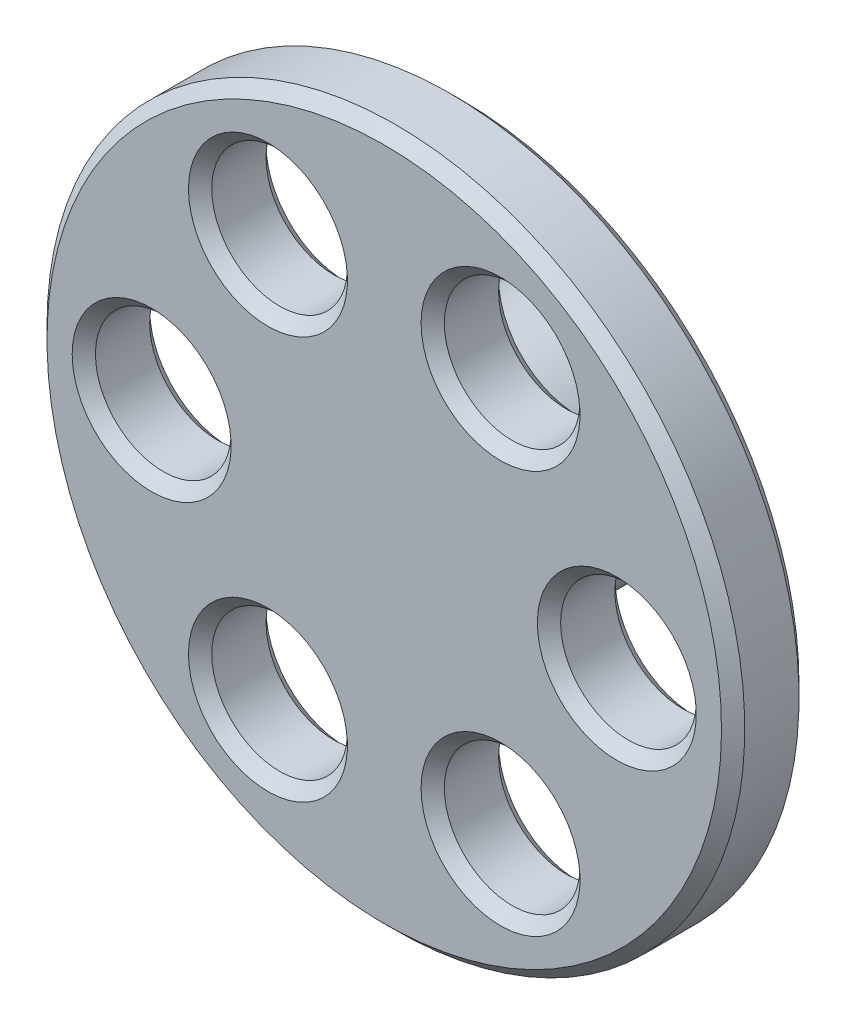
ISO-10303-21;
HEADER;
FILE_DESCRIPTION(('STEP AP214'),'2;1');
FILE_NAME('part.step','',(''),(''),'','','');
FILE_SCHEMA(('AUTOMOTIVE_DESIGN { 1 0 10303 214 1 1 1 1 }'));
ENDSEC;
DATA;
#1=APPLICATION_CONTEXT('core data for automotive mechanical design processes');
#2=APPLICATION_PROTOCOL_DEFINITION('international standard','automotive_design',2000,#1);
#3=PRODUCT_CONTEXT('',#1,'mechanical');
#4=PRODUCT('Part','Part','',(#3));
#5=PRODUCT_RELATED_PRODUCT_CATEGORY('part','',(#4));
#6=PRODUCT_DEFINITION_FORMATION('','',#4);
#7=PRODUCT_DEFINITION_CONTEXT('part definition',#1,'design');
#8=PRODUCT_DEFINITION('design','',#6,#7);
#9=PRODUCT_DEFINITION_SHAPE('','',#8);
#10=(LENGTH_UNIT() NAMED_UNIT(*) SI_UNIT(.MILLI.,.METRE.));
#11=(NAMED_UNIT(*) PLANE_ANGLE_UNIT() SI_UNIT($,.RADIAN.));
#12=(NAMED_UNIT(*) SI_UNIT($,.STERADIAN.) SOLID_ANGLE_UNIT());
#13=UNCERTAINTY_MEASURE_WITH_UNIT(LENGTH_MEASURE(1.E-05),#10,'distance_accuracy_value','');
#14=(GEOMETRIC_REPRESENTATION_CONTEXT(3) GLOBAL_UNCERTAINTY_ASSIGNED_CONTEXT((#13)) GLOBAL_UNIT_ASSIGNED_CONTEXT((#10,
#11,#12)) REPRESENTATION_CONTEXT('',''));
#15=CARTESIAN_POINT('',(0.,0.,0.));
#16=DIRECTION('',(0.,0.,1.));
#17=DIRECTION('',(1.,0.,0.));
#18=AXIS2_PLACEMENT_3D('',#15,#16,#17);
#19=CARTESIAN_POINT('',(-3.,-5.19615242270662,-14.35));
#20=DIRECTION('',(0.,0.,-1.));
#21=DIRECTION('',(0.5,-0.866025403784442,0.));
#22=AXIS2_PLACEMENT_3D('',#19,#20,#21);
#23=CYLINDRICAL_SURFACE('',#22,1.75);
#24=CARTESIAN_POINT('',(-3.,-5.19615242270662,-14.65));
#25=DIRECTION('',(0.,0.,1.));
#26=DIRECTION('',(0.5,-0.866025403784442,0.));
#27=AXIS2_PLACEMENT_3D('',#24,#25,#26);
#28=CIRCLE('',#27,1.75);
#29=CARTESIAN_POINT('',(-2.12500000000003,-6.71169687932939,-14.65));
#30=VERTEX_POINT('',#29);
#31=EDGE_CURVE('E11',#30,#30,#28,.T.);
#32=ORIENTED_EDGE('',*,*,#31,.T.);
#33=EDGE_LOOP('',(#32));
#34=FACE_BOUND('',#33,.T.);
#35=CARTESIAN_POINT('',(-3.,-5.19615242270662,-16.05));
#36=DIRECTION('',(0.,0.,-1.));
#37=DIRECTION('',(0.5,-0.866025403784442,0.));
#38=AXIS2_PLACEMENT_3D('',#35,#36,#37);
#39=CIRCLE('',#38,1.75);
#40=CARTESIAN_POINT('',(-2.12500000000003,-6.71169687932939,-16.05));
#41=VERTEX_POINT('',#40);
#42=EDGE_CURVE('E28',#41,#41,#39,.T.);
#43=ORIENTED_EDGE('',*,*,#42,.T.);
#44=EDGE_LOOP('',(#43));
#45=FACE_BOUND('',#44,.T.);
#46=ADVANCED_FACE('F17',(#34,#45),#23,.F.);
#47=CARTESIAN_POINT('',(6.,0.,-14.35));
#48=DIRECTION('',(0.,0.,-1.));
#49=DIRECTION('',(0.5,-0.866025403784442,0.));
#50=AXIS2_PLACEMENT_3D('',#47,#48,#49);
#51=CYLINDRICAL_SURFACE('',#50,1.75);
#52=CARTESIAN_POINT('',(6.,0.,-14.65));
#53=DIRECTION('',(0.,0.,1.));
#54=DIRECTION('',(0.5,-0.866025403784442,0.));
#55=AXIS2_PLACEMENT_3D('',#52,#53,#54);
#56=CIRCLE('',#55,1.75);
#57=CARTESIAN_POINT('',(6.875,-1.5155444566228,-14.65));
#58=VERTEX_POINT('',#57);
#59=EDGE_CURVE('E237',#58,#58,#56,.T.);
#60=ORIENTED_EDGE('',*,*,#59,.T.);
#61=EDGE_LOOP('',(#60));
#62=FACE_BOUND('',#61,.T.);
#63=CARTESIAN_POINT('',(6.,0.,-16.05));
#64=DIRECTION('',(0.,0.,-1.));
#65=DIRECTION('',(0.5,-0.866025403784442,0.));
#66=AXIS2_PLACEMENT_3D('',#63,#64,#65);
#67=CIRCLE('',#66,1.75);
#68=CARTESIAN_POINT('',(6.875,-1.5155444566228,-16.05));
#69=VERTEX_POINT('',#68);
#70=EDGE_CURVE('E233',#69,#69,#67,.T.);
#71=ORIENTED_EDGE('',*,*,#70,.T.);
#72=EDGE_LOOP('',(#71));
#73=FACE_BOUND('',#72,.T.);
#74=ADVANCED_FACE('F263',(#62,#73),#51,.F.);
#75=CARTESIAN_POINT('',(-6.,0.,-14.35));
#76=DIRECTION('',(0.,0.,-1.));
#77=DIRECTION('',(0.5,-0.866025403784442,0.));
#78=AXIS2_PLACEMENT_3D('',#75,#76,#77);
#79=CYLINDRICAL_SURFACE('',#78,1.75);
#80=CARTESIAN_POINT('',(-6.,0.,-14.65));
#81=DIRECTION('',(0.,0.,1.));
#82=DIRECTION('',(0.5,-0.866025403784442,0.));
#83=AXIS2_PLACEMENT_3D('',#80,#81,#82);
#84=CIRCLE('',#83,1.75);
#85=CARTESIAN_POINT('',(-5.125,-1.51554445662276,-14.65));
#86=VERTEX_POINT('',#85);
#87=EDGE_CURVE('E229',#86,#86,#84,.T.);
#88=ORIENTED_EDGE('',*,*,#87,.T.);
#89=EDGE_LOOP('',(#88));
#90=FACE_BOUND('',#89,.T.);
#91=CARTESIAN_POINT('',(-6.,0.,-16.05));
#92=DIRECTION('',(0.,0.,-1.));
#93=DIRECTION('',(0.5,-0.866025403784442,0.));
#94=AXIS2_PLACEMENT_3D('',#91,#92,#93);
#95=CIRCLE('',#94,1.75);
#96=CARTESIAN_POINT('',(-5.125,-1.51554445662276,-16.05));
#97=VERTEX_POINT('',#96);
#98=EDGE_CURVE('E225',#97,#97,#95,.T.);
#99=ORIENTED_EDGE('',*,*,#98,.T.);
#100=EDGE_LOOP('',(#99));
#101=FACE_BOUND('',#100,.T.);
#102=ADVANCED_FACE('F269',(#90,#101),#79,.F.);
#103=CARTESIAN_POINT('',(3.,5.19615242270661,-14.35));
#104=DIRECTION('',(0.,0.,-1.));
#105=DIRECTION('',(0.5,-0.866025403784442,0.));
#106=AXIS2_PLACEMENT_3D('',#103,#104,#105);
#107=CYLINDRICAL_SURFACE('',#106,1.75);
#108=CARTESIAN_POINT('',(3.,5.19615242270661,-14.65));
#109=DIRECTION('',(0.,0.,1.));
#110=DIRECTION('',(0.5,-0.866025403784442,0.));
#111=AXIS2_PLACEMENT_3D('',#108,#109,#110);
#112=CIRCLE('',#111,1.75);
#113=CARTESIAN_POINT('',(3.875,3.68060796608384,-14.65));
#114=VERTEX_POINT('',#113);
#115=EDGE_CURVE('E221',#114,#114,#112,.T.);
#116=ORIENTED_EDGE('',*,*,#115,.T.);
#117=EDGE_LOOP('',(#116));
#118=FACE_BOUND('',#117,.T.);
#119=CARTESIAN_POINT('',(3.,5.19615242270661,-16.05));
#120=DIRECTION('',(0.,0.,-1.));
#121=DIRECTION('',(0.5,-0.866025403784442,0.));
#122=AXIS2_PLACEMENT_3D('',#119,#120,#121);
#123=CIRCLE('',#122,1.75);
#124=CARTESIAN_POINT('',(3.875,3.68060796608384,-16.05));
#125=VERTEX_POINT('',#124);
#126=EDGE_CURVE('E217',#125,#125,#123,.T.);
#127=ORIENTED_EDGE('',*,*,#126,.T.);
#128=EDGE_LOOP('',(#127));
#129=FACE_BOUND('',#128,.T.);
#130=ADVANCED_FACE('F275',(#118,#129),#107,.F.);
#131=CARTESIAN_POINT('',(-3.,5.19615242270665,-14.35));
#132=DIRECTION('',(0.,0.,-1.));
#133=DIRECTION('',(0.5,-0.866025403784442,0.));
#134=AXIS2_PLACEMENT_3D('',#131,#132,#133);
#135=CYLINDRICAL_SURFACE('',#134,1.75);
#136=CARTESIAN_POINT('',(-3.,5.19615242270665,-14.65));
#137=DIRECTION('',(0.,0.,1.));
#138=DIRECTION('',(0.5,-0.866025403784442,0.));
#139=AXIS2_PLACEMENT_3D('',#136,#137,#138);
#140=CIRCLE('',#139,1.75);
#141=CARTESIAN_POINT('',(-2.125,3.68060796608387,-14.65));
#142=VERTEX_POINT('',#141);
#143=EDGE_CURVE('E214',#142,#142,#140,.T.);
#144=ORIENTED_EDGE('',*,*,#143,.T.);
#145=EDGE_LOOP('',(#144));
#146=FACE_BOUND('',#145,.T.);
#147=CARTESIAN_POINT('',(-3.,5.19615242270665,-16.05));
#148=DIRECTION('',(0.,0.,-1.));
#149=DIRECTION('',(0.5,-0.866025403784442,0.));
#150=AXIS2_PLACEMENT_3D('',#147,#148,#149);
#151=CIRCLE('',#150,1.75);
#152=CARTESIAN_POINT('',(-2.125,3.68060796608387,-16.05));
#153=VERTEX_POINT('',#152);
#154=EDGE_CURVE('E211',#153,#153,#151,.T.);
#155=ORIENTED_EDGE('',*,*,#154,.T.);
#156=EDGE_LOOP('',(#155));
#157=FACE_BOUND('',#156,.T.);
#158=ADVANCED_FACE('F279',(#146,#157),#135,.F.);
#159=CARTESIAN_POINT('',(0.,0.,-14.35));
#160=DIRECTION('',(0.,0.,-1.));
#161=DIRECTION('',(0.5,-0.866025403784442,0.));
#162=AXIS2_PLACEMENT_3D('',#159,#160,#161);
#163=CYLINDRICAL_SURFACE('',#162,9.);
#164=CARTESIAN_POINT('',(0.,0.,-14.65));
#165=DIRECTION('',(0.,0.,-1.));
#166=DIRECTION('',(0.5,-0.866025403784442,0.));
#167=AXIS2_PLACEMENT_3D('',#164,#165,#166);
#168=CIRCLE('',#167,9.);
#169=CARTESIAN_POINT('',(4.49999999999995,-7.79422863405998,-14.65));
#170=VERTEX_POINT('',#169);
#171=EDGE_CURVE('E207',#170,#170,#168,.T.);
#172=ORIENTED_EDGE('',*,*,#171,.T.);
#173=EDGE_LOOP('',(#172));
#174=FACE_BOUND('',#173,.T.);
#175=CARTESIAN_POINT('',(0.,0.,-16.05));
#176=DIRECTION('',(0.,0.,1.));
#177=DIRECTION('',(0.5,-0.866025403784442,0.));
#178=AXIS2_PLACEMENT_3D('',#175,#176,#177);
#179=CIRCLE('',#178,9.);
#180=CARTESIAN_POINT('',(4.49999999999995,-7.79422863405998,-16.05));
#181=VERTEX_POINT('',#180);
#182=EDGE_CURVE('E203',#181,#181,#179,.T.);
#183=ORIENTED_EDGE('',*,*,#182,.T.);
#184=EDGE_LOOP('',(#183));
#185=FACE_BOUND('',#184,.T.);
#186=ADVANCED_FACE('F283',(#174,#185),#163,.T.);
#187=CARTESIAN_POINT('',(3.,-5.19615242270665,-14.35));
#188=DIRECTION('',(0.,0.,-1.));
#189=DIRECTION('',(0.5,-0.866025403784442,0.));
#190=AXIS2_PLACEMENT_3D('',#187,#188,#189);
#191=CYLINDRICAL_SURFACE('',#190,1.75);
#192=CARTESIAN_POINT('',(3.,-5.19615242270665,-14.65));
#193=DIRECTION('',(0.,0.,1.));
#194=DIRECTION('',(0.5,-0.866025403784442,0.));
#195=AXIS2_PLACEMENT_3D('',#192,#193,#194);
#196=CIRCLE('',#195,1.75);
#197=CARTESIAN_POINT('',(3.875,-6.71169687932942,-14.65));
#198=VERTEX_POINT('',#197);
#199=EDGE_CURVE('E200',#198,#198,#196,.T.);
#200=ORIENTED_EDGE('',*,*,#199,.T.);
#201=EDGE_LOOP('',(#200));
#202=FACE_BOUND('',#201,.T.);
#203=CARTESIAN_POINT('',(3.,-5.19615242270665,-16.05));
#204=DIRECTION('',(0.,0.,-1.));
#205=DIRECTION('',(0.5,-0.866025403784442,0.));
#206=AXIS2_PLACEMENT_3D('',#203,#204,#205);
#207=CIRCLE('',#206,1.75);
#208=CARTESIAN_POINT('',(3.875,-6.71169687932942,-16.05));
#209=VERTEX_POINT('',#208);
#210=EDGE_CURVE('E196',#209,#209,#207,.T.);
#211=ORIENTED_EDGE('',*,*,#210,.T.);
#212=EDGE_LOOP('',(#211));
#213=FACE_BOUND('',#212,.T.);
#214=ADVANCED_FACE('F287',(#202,#213),#191,.F.);
#215=CARTESIAN_POINT('',(-1.49999999999998,2.59807621135332,-14.35));
#216=DIRECTION('',(0.,0.,1.));
#217=DIRECTION('',(-0.5,0.866025403784442,0.));
#218=AXIS2_PLACEMENT_3D('',#215,#216,#217);
#219=PLANE('',#218);
#220=CARTESIAN_POINT('',(0.,0.,-14.35));
#221=DIRECTION('',(0.,0.,1.));
#222=DIRECTION('',(0.5,-0.866025403784442,0.));
#223=AXIS2_PLACEMENT_3D('',#220,#221,#222);
#224=CIRCLE('',#223,8.7);
#225=CARTESIAN_POINT('',(4.34999999999995,-7.53442101292465,-14.35));
#226=VERTEX_POINT('',#225);
#227=EDGE_CURVE('E192',#226,#226,#224,.T.);
#228=ORIENTED_EDGE('',*,*,#227,.T.);
#229=EDGE_LOOP('',(#228));
#230=FACE_BOUND('',#229,.T.);
#231=CARTESIAN_POINT('',(3.,5.19615242270661,-14.35));
#232=DIRECTION('',(0.,0.,-1.));
#233=DIRECTION('',(0.5,-0.866025403784442,0.));
#234=AXIS2_PLACEMENT_3D('',#231,#232,#233);
#235=CIRCLE('',#234,2.05);
#236=CARTESIAN_POINT('',(4.025,3.42080034494851,-14.35));
#237=VERTEX_POINT('',#236);
#238=EDGE_CURVE('E188',#237,#237,#235,.T.);
#239=ORIENTED_EDGE('',*,*,#238,.T.);
#240=EDGE_LOOP('',(#239));
#241=FACE_BOUND('',#240,.T.);
#242=CARTESIAN_POINT('',(-6.,0.,-14.35));
#243=DIRECTION('',(0.,0.,-1.));
#244=DIRECTION('',(0.5,-0.866025403784442,0.));
#245=AXIS2_PLACEMENT_3D('',#242,#243,#244);
#246=CIRCLE('',#245,2.05);
#247=CARTESIAN_POINT('',(-4.975,-1.77535207775809,-14.35));
#248=VERTEX_POINT('',#247);
#249=EDGE_CURVE('E184',#248,#248,#246,.T.);
#250=ORIENTED_EDGE('',*,*,#249,.T.);
#251=EDGE_LOOP('',(#250));
#252=FACE_BOUND('',#251,.T.);
#253=CARTESIAN_POINT('',(-3.,-5.19615242270662,-14.35));
#254=DIRECTION('',(0.,0.,-1.));
#255=DIRECTION('',(0.5,-0.866025403784442,0.));
#256=AXIS2_PLACEMENT_3D('',#253,#254,#255);
#257=CIRCLE('',#256,2.05);
#258=CARTESIAN_POINT('',(-1.97500000000003,-6.97150450046472,-14.35));
#259=VERTEX_POINT('',#258);
#260=EDGE_CURVE('E180',#259,#259,#257,.T.);
#261=ORIENTED_EDGE('',*,*,#260,.T.);
#262=EDGE_LOOP('',(#261));
#263=FACE_BOUND('',#262,.T.);
#264=CARTESIAN_POINT('',(3.,-5.19615242270665,-14.35));
#265=DIRECTION('',(0.,0.,-1.));
#266=DIRECTION('',(0.5,-0.866025403784442,0.));
#267=AXIS2_PLACEMENT_3D('',#264,#265,#266);
#268=CIRCLE('',#267,2.05);
#269=CARTESIAN_POINT('',(4.025,-6.97150450046475,-14.35));
#270=VERTEX_POINT('',#269);
#271=EDGE_CURVE('E176',#270,#270,#268,.T.);
#272=ORIENTED_EDGE('',*,*,#271,.T.);
#273=EDGE_LOOP('',(#272));
#274=FACE_BOUND('',#273,.T.);
#275=CARTESIAN_POINT('',(6.,0.,-14.35));
#276=DIRECTION('',(0.,0.,-1.));
#277=DIRECTION('',(0.5,-0.866025403784442,0.));
#278=AXIS2_PLACEMENT_3D('',#275,#276,#277);
#279=CIRCLE('',#278,2.05);
#280=CARTESIAN_POINT('',(7.025,-1.77535207775813,-14.35));
#281=VERTEX_POINT('',#280);
#282=EDGE_CURVE('E172',#281,#281,#279,.T.);
#283=ORIENTED_EDGE('',*,*,#282,.T.);
#284=EDGE_LOOP('',(#283));
#285=FACE_BOUND('',#284,.T.);
#286=CARTESIAN_POINT('',(-3.,5.19615242270665,-14.35));
#287=DIRECTION('',(0.,0.,-1.));
#288=DIRECTION('',(0.5,-0.866025403784442,0.));
#289=AXIS2_PLACEMENT_3D('',#286,#287,#288);
#290=CIRCLE('',#289,2.05);
#291=CARTESIAN_POINT('',(-1.975,3.42080034494854,-14.35));
#292=VERTEX_POINT('',#291);
#293=EDGE_CURVE('E168',#292,#292,#290,.T.);
#294=ORIENTED_EDGE('',*,*,#293,.T.);
#295=EDGE_LOOP('',(#294));
#296=FACE_BOUND('',#295,.T.);
#297=ADVANCED_FACE('F291',(#230,#241,#252,#263,#274,#285,#296),#219,.T.);
#298=CARTESIAN_POINT('',(-1.49999999999998,2.59807621135332,-16.35));
#299=DIRECTION('',(0.,0.,1.));
#300=DIRECTION('',(-0.5,0.866025403784442,0.));
#301=AXIS2_PLACEMENT_3D('',#298,#299,#300);
#302=PLANE('',#301);
#303=CARTESIAN_POINT('',(-6.,0.,-16.35));
#304=DIRECTION('',(0.,0.,1.));
#305=DIRECTION('',(0.5,-0.866025403784442,0.));
#306=AXIS2_PLACEMENT_3D('',#303,#304,#305);
#307=CIRCLE('',#306,2.05);
#308=CARTESIAN_POINT('',(-4.975,-1.77535207775809,-16.35));
#309=VERTEX_POINT('',#308);
#310=EDGE_CURVE('E164',#309,#309,#307,.T.);
#311=ORIENTED_EDGE('',*,*,#310,.T.);
#312=EDGE_LOOP('',(#311));
#313=FACE_BOUND('',#312,.T.);
#314=CARTESIAN_POINT('',(-3.,-5.19615242270662,-16.35));
#315=DIRECTION('',(0.,0.,1.));
#316=DIRECTION('',(0.5,-0.866025403784442,0.));
#317=AXIS2_PLACEMENT_3D('',#314,#315,#316);
#318=CIRCLE('',#317,2.05);
#319=CARTESIAN_POINT('',(-1.97500000000003,-6.97150450046472,-16.35));
#320=VERTEX_POINT('',#319);
#321=EDGE_CURVE('E160',#320,#320,#318,.T.);
#322=ORIENTED_EDGE('',*,*,#321,.T.);
#323=EDGE_LOOP('',(#322));
#324=FACE_BOUND('',#323,.T.);
#325=CARTESIAN_POINT('',(3.,-5.19615242270665,-16.35));
#326=DIRECTION('',(0.,0.,1.));
#327=DIRECTION('',(0.5,-0.866025403784442,0.));
#328=AXIS2_PLACEMENT_3D('',#325,#326,#327);
#329=CIRCLE('',#328,2.05);
#330=CARTESIAN_POINT('',(4.025,-6.97150450046475,-16.35));
#331=VERTEX_POINT('',#330);
#332=EDGE_CURVE('E156',#331,#331,#329,.T.);
#333=ORIENTED_EDGE('',*,*,#332,.T.);
#334=EDGE_LOOP('',(#333));
#335=FACE_BOUND('',#334,.T.);
#336=CARTESIAN_POINT('',(3.,5.19615242270661,-16.35));
#337=DIRECTION('',(0.,0.,1.));
#338=DIRECTION('',(0.5,-0.866025403784442,0.));
#339=AXIS2_PLACEMENT_3D('',#336,#337,#338);
#340=CIRCLE('',#339,2.05);
#341=CARTESIAN_POINT('',(4.025,3.42080034494851,-16.35));
#342=VERTEX_POINT('',#341);
#343=EDGE_CURVE('E152',#342,#342,#340,.T.);
#344=ORIENTED_EDGE('',*,*,#343,.T.);
#345=EDGE_LOOP('',(#344));
#346=FACE_BOUND('',#345,.T.);
#347=CARTESIAN_POINT('',(6.,0.,-16.35));
#348=DIRECTION('',(0.,0.,1.));
#349=DIRECTION('',(0.5,-0.866025403784442,0.));
#350=AXIS2_PLACEMENT_3D('',#347,#348,#349);
#351=CIRCLE('',#350,2.05);
#352=CARTESIAN_POINT('',(7.025,-1.77535207775813,-16.35));
#353=VERTEX_POINT('',#352);
#354=EDGE_CURVE('E148',#353,#353,#351,.T.);
#355=ORIENTED_EDGE('',*,*,#354,.T.);
#356=EDGE_LOOP('',(#355));
#357=FACE_BOUND('',#356,.T.);
#358=CARTESIAN_POINT('',(-3.,5.19615242270665,-16.35));
#359=DIRECTION('',(0.,0.,1.));
#360=DIRECTION('',(0.5,-0.866025403784442,0.));
#361=AXIS2_PLACEMENT_3D('',#358,#359,#360);
#362=CIRCLE('',#361,2.05);
#363=CARTESIAN_POINT('',(-1.975,3.42080034494854,-16.35));
#364=VERTEX_POINT('',#363);
#365=EDGE_CURVE('E144',#364,#364,#362,.T.);
#366=ORIENTED_EDGE('',*,*,#365,.T.);
#367=EDGE_LOOP('',(#366));
#368=FACE_BOUND('',#367,.T.);
#369=CARTESIAN_POINT('',(0.,0.,-16.35));
#370=DIRECTION('',(0.,0.,-1.));
#371=DIRECTION('',(0.5,-0.866025403784442,0.));
#372=AXIS2_PLACEMENT_3D('',#369,#370,#371);
#373=CIRCLE('',#372,8.7);
#374=CARTESIAN_POINT('',(4.34999999999995,-7.53442101292465,-16.35));
#375=VERTEX_POINT('',#374);
#376=EDGE_CURVE('E138',#375,#375,#373,.T.);
#377=ORIENTED_EDGE('',*,*,#376,.T.);
#378=EDGE_LOOP('',(#377));
#379=FACE_BOUND('',#378,.T.);
#380=CARTESIAN_POINT('',(0.,0.,-16.35));
#381=DIRECTION('',(0.,0.,1.));
#382=DIRECTION('',(-0.5,0.866025403784442,0.));
#383=AXIS2_PLACEMENT_3D('',#380,#381,#382);
#384=CIRCLE('',#383,3.);
#385=CARTESIAN_POINT('',(-1.49999999999998,2.59807621135332,-16.35));
#386=VERTEX_POINT('',#385);
#387=EDGE_CURVE('E131',#386,#386,#384,.T.);
#388=ORIENTED_EDGE('',*,*,#387,.T.);
#389=EDGE_LOOP('',(#388));
#390=FACE_BOUND('',#389,.T.);
#391=ADVANCED_FACE('F295',(#313,#324,#335,#346,#357,#368,#379,#390),#302,.F.);
#392=CARTESIAN_POINT('',(0.,0.,-19.35));
#393=DIRECTION('',(0.,0.,1.));
#394=DIRECTION('',(-0.5,0.866025403784442,0.));
#395=AXIS2_PLACEMENT_3D('',#392,#393,#394);
#396=CYLINDRICAL_SURFACE('',#395,3.);
#397=CARTESIAN_POINT('',(0.,0.,-19.55));
#398=DIRECTION('',(0.,0.,1.));
#399=DIRECTION('',(0.5,-0.866025403784442,0.));
#400=AXIS2_PLACEMENT_3D('',#397,#398,#399);
#401=CIRCLE('',#400,3.);
#402=CARTESIAN_POINT('',(1.49999999999998,-2.59807621135332,-19.55));
#403=VERTEX_POINT('',#402);
#404=EDGE_CURVE('E121',#403,#403,#401,.T.);
#405=ORIENTED_EDGE('',*,*,#404,.T.);
#406=EDGE_LOOP('',(#405));
#407=FACE_BOUND('',#406,.T.);
#408=ORIENTED_EDGE('',*,*,#387,.F.);
#409=EDGE_LOOP('',(#408));
#410=FACE_BOUND('',#409,.T.);
#411=ADVANCED_FACE('F299',(#407,#410),#396,.T.);
#412=CARTESIAN_POINT('',(0.,0.,-19.85));
#413=DIRECTION('',(0.,0.,1.));
#414=DIRECTION('',(-0.5,0.866025403784442,0.));
#415=AXIS2_PLACEMENT_3D('',#412,#413,#414);
#416=PLANE('',#415);
#417=CARTESIAN_POINT('',(0.,0.,-19.85));
#418=DIRECTION('',(0.,0.,-1.));
#419=DIRECTION('',(0.5,-0.866025403784442,0.));
#420=AXIS2_PLACEMENT_3D('',#417,#418,#419);
#421=CIRCLE('',#420,2.7);
#422=CARTESIAN_POINT('',(1.34999999999998,-2.33826859021799,-19.85));
#423=VERTEX_POINT('',#422);
#424=EDGE_CURVE('E21',#423,#423,#421,.T.);
#425=ORIENTED_EDGE('',*,*,#424,.T.);
#426=EDGE_LOOP('',(#425));
#427=FACE_BOUND('',#426,.T.);
#428=ADVANCED_FACE('F303',(#427),#416,.F.);
#429=CARTESIAN_POINT('',(0.,0.,-14.35));
#430=DIRECTION('',(0.,0.,-1.));
#431=DIRECTION('',(0.5,-0.866025403784442,0.));
#432=AXIS2_PLACEMENT_3D('',#429,#430,#431);
#433=CONICAL_SURFACE('',#432,8.7,0.785398163397448);
#434=ORIENTED_EDGE('',*,*,#171,.F.);
#435=EDGE_LOOP('',(#434));
#436=FACE_BOUND('',#435,.T.);
#437=ORIENTED_EDGE('',*,*,#227,.F.);
#438=EDGE_LOOP('',(#437));
#439=FACE_BOUND('',#438,.T.);
#440=ADVANCED_FACE('F306',(#436,#439),#433,.T.);
#441=CARTESIAN_POINT('',(3.,5.19615242270661,-14.35));
#442=DIRECTION('',(0.,0.,1.));
#443=DIRECTION('',(-0.5,0.866025403784442,0.));
#444=AXIS2_PLACEMENT_3D('',#441,#442,#443);
#445=CONICAL_SURFACE('',#444,2.05,0.785398163397448);
#446=ORIENTED_EDGE('',*,*,#115,.F.);
#447=EDGE_LOOP('',(#446));
#448=FACE_BOUND('',#447,.T.);
#449=ORIENTED_EDGE('',*,*,#238,.F.);
#450=EDGE_LOOP('',(#449));
#451=FACE_BOUND('',#450,.T.);
#452=ADVANCED_FACE('F309',(#448,#451),#445,.F.);
#453=CARTESIAN_POINT('',(-6.,0.,-14.35));
#454=DIRECTION('',(0.,0.,1.));
#455=DIRECTION('',(-0.5,0.866025403784442,0.));
#456=AXIS2_PLACEMENT_3D('',#453,#454,#455);
#457=CONICAL_SURFACE('',#456,2.05,0.785398163397448);
#458=ORIENTED_EDGE('',*,*,#87,.F.);
#459=EDGE_LOOP('',(#458));
#460=FACE_BOUND('',#459,.T.);
#461=ORIENTED_EDGE('',*,*,#249,.F.);
#462=EDGE_LOOP('',(#461));
#463=FACE_BOUND('',#462,.T.);
#464=ADVANCED_FACE('F313',(#460,#463),#457,.F.);
#465=CARTESIAN_POINT('',(-6.,0.,-16.05));
#466=DIRECTION('',(0.,0.,-1.));
#467=DIRECTION('',(0.5,-0.866025403784442,0.));
#468=AXIS2_PLACEMENT_3D('',#465,#466,#467);
#469=CONICAL_SURFACE('',#468,1.75,0.785398163397448);
#470=ORIENTED_EDGE('',*,*,#310,.F.);
#471=EDGE_LOOP('',(#470));
#472=FACE_BOUND('',#471,.T.);
#473=ORIENTED_EDGE('',*,*,#98,.F.);
#474=EDGE_LOOP('',(#473));
#475=FACE_BOUND('',#474,.T.);
#476=ADVANCED_FACE('F260',(#472,#475),#469,.F.);
#477=CARTESIAN_POINT('',(-3.,-5.19615242270662,-14.35));
#478=DIRECTION('',(0.,0.,1.));
#479=DIRECTION('',(-0.5,0.866025403784442,0.));
#480=AXIS2_PLACEMENT_3D('',#477,#478,#479);
#481=CONICAL_SURFACE('',#480,2.05,0.785398163397448);
#482=ORIENTED_EDGE('',*,*,#31,.F.);
#483=EDGE_LOOP('',(#482));
#484=FACE_BOUND('',#483,.T.);
#485=ORIENTED_EDGE('',*,*,#260,.F.);
#486=EDGE_LOOP('',(#485));
#487=FACE_BOUND('',#486,.T.);
#488=ADVANCED_FACE('F249',(#484,#487),#481,.F.);
#489=CARTESIAN_POINT('',(-3.,-5.19615242270662,-16.05));
#490=DIRECTION('',(0.,0.,-1.));
#491=DIRECTION('',(0.5,-0.866025403784442,0.));
#492=AXIS2_PLACEMENT_3D('',#489,#490,#491);
#493=CONICAL_SURFACE('',#492,1.75,0.785398163397448);
#494=ORIENTED_EDGE('',*,*,#321,.F.);
#495=EDGE_LOOP('',(#494));
#496=FACE_BOUND('',#495,.T.);
#497=ORIENTED_EDGE('',*,*,#42,.F.);
#498=EDGE_LOOP('',(#497));
#499=FACE_BOUND('',#498,.T.);
#500=ADVANCED_FACE('F246',(#496,#499),#493,.F.);
#501=CARTESIAN_POINT('',(3.,-5.19615242270665,-14.35));
#502=DIRECTION('',(0.,0.,1.));
#503=DIRECTION('',(-0.5,0.866025403784442,0.));
#504=AXIS2_PLACEMENT_3D('',#501,#502,#503);
#505=CONICAL_SURFACE('',#504,2.05,0.785398163397448);
#506=ORIENTED_EDGE('',*,*,#199,.F.);
#507=EDGE_LOOP('',(#506));
#508=FACE_BOUND('',#507,.T.);
#509=ORIENTED_EDGE('',*,*,#271,.F.);
#510=EDGE_LOOP('',(#509));
#511=FACE_BOUND('',#510,.T.);
#512=ADVANCED_FACE('F248',(#508,#511),#505,.F.);
#513=CARTESIAN_POINT('',(3.,-5.19615242270665,-16.05));
#514=DIRECTION('',(0.,0.,-1.));
#515=DIRECTION('',(0.5,-0.866025403784442,0.));
#516=AXIS2_PLACEMENT_3D('',#513,#514,#515);
#517=CONICAL_SURFACE('',#516,1.75,0.785398163397448);
#518=ORIENTED_EDGE('',*,*,#332,.F.);
#519=EDGE_LOOP('',(#518));
#520=FACE_BOUND('',#519,.T.);
#521=ORIENTED_EDGE('',*,*,#210,.F.);
#522=EDGE_LOOP('',(#521));
#523=FACE_BOUND('',#522,.T.);
#524=ADVANCED_FACE('F257',(#520,#523),#517,.F.);
#525=CARTESIAN_POINT('',(6.,0.,-14.35));
#526=DIRECTION('',(0.,0.,1.));
#527=DIRECTION('',(-0.5,0.866025403784442,0.));
#528=AXIS2_PLACEMENT_3D('',#525,#526,#527);
#529=CONICAL_SURFACE('',#528,2.05,0.785398163397448);
#530=ORIENTED_EDGE('',*,*,#59,.F.);
#531=EDGE_LOOP('',(#530));
#532=FACE_BOUND('',#531,.T.);
#533=ORIENTED_EDGE('',*,*,#282,.F.);
#534=EDGE_LOOP('',(#533));
#535=FACE_BOUND('',#534,.T.);
#536=ADVANCED_FACE('F356',(#532,#535),#529,.F.);
#537=CARTESIAN_POINT('',(3.,5.19615242270661,-16.05));
#538=DIRECTION('',(0.,0.,-1.));
#539=DIRECTION('',(0.5,-0.866025403784442,0.));
#540=AXIS2_PLACEMENT_3D('',#537,#538,#539);
#541=CONICAL_SURFACE('',#540,1.75,0.785398163397448);
#542=ORIENTED_EDGE('',*,*,#343,.F.);
#543=EDGE_LOOP('',(#542));
#544=FACE_BOUND('',#543,.T.);
#545=ORIENTED_EDGE('',*,*,#126,.F.);
#546=EDGE_LOOP('',(#545));
#547=FACE_BOUND('',#546,.T.);
#548=ADVANCED_FACE('F352',(#544,#547),#541,.F.);
#549=CARTESIAN_POINT('',(6.,0.,-16.05));
#550=DIRECTION('',(0.,0.,-1.));
#551=DIRECTION('',(0.5,-0.866025403784442,0.));
#552=AXIS2_PLACEMENT_3D('',#549,#550,#551);
#553=CONICAL_SURFACE('',#552,1.75,0.785398163397448);
#554=ORIENTED_EDGE('',*,*,#354,.F.);
#555=EDGE_LOOP('',(#554));
#556=FACE_BOUND('',#555,.T.);
#557=ORIENTED_EDGE('',*,*,#70,.F.);
#558=EDGE_LOOP('',(#557));
#559=FACE_BOUND('',#558,.T.);
#560=ADVANCED_FACE('F348',(#556,#559),#553,.F.);
#561=CARTESIAN_POINT('',(-3.,5.19615242270665,-14.35));
#562=DIRECTION('',(0.,0.,1.));
#563=DIRECTION('',(-0.5,0.866025403784442,0.));
#564=AXIS2_PLACEMENT_3D('',#561,#562,#563);
#565=CONICAL_SURFACE('',#564,2.05,0.785398163397448);
#566=ORIENTED_EDGE('',*,*,#143,.F.);
#567=EDGE_LOOP('',(#566));
#568=FACE_BOUND('',#567,.T.);
#569=ORIENTED_EDGE('',*,*,#293,.F.);
#570=EDGE_LOOP('',(#569));
#571=FACE_BOUND('',#570,.T.);
#572=ADVANCED_FACE('F342',(#568,#571),#565,.F.);
#573=CARTESIAN_POINT('',(-3.,5.19615242270665,-16.05));
#574=DIRECTION('',(0.,0.,-1.));
#575=DIRECTION('',(0.5,-0.866025403784442,0.));
#576=AXIS2_PLACEMENT_3D('',#573,#574,#575);
#577=CONICAL_SURFACE('',#576,1.75,0.785398163397448);
#578=ORIENTED_EDGE('',*,*,#365,.F.);
#579=EDGE_LOOP('',(#578));
#580=FACE_BOUND('',#579,.T.);
#581=ORIENTED_EDGE('',*,*,#154,.F.);
#582=EDGE_LOOP('',(#581));
#583=FACE_BOUND('',#582,.T.);
#584=ADVANCED_FACE('F336',(#580,#583),#577,.F.);
#585=CARTESIAN_POINT('',(0.,0.,-16.05));
#586=DIRECTION('',(0.,0.,1.));
#587=DIRECTION('',(-0.5,0.866025403784442,0.));
#588=AXIS2_PLACEMENT_3D('',#585,#586,#587);
#589=CONICAL_SURFACE('',#588,9.,0.785398163397448);
#590=ORIENTED_EDGE('',*,*,#376,.F.);
#591=EDGE_LOOP('',(#590));
#592=FACE_BOUND('',#591,.T.);
#593=ORIENTED_EDGE('',*,*,#182,.F.);
#594=EDGE_LOOP('',(#593));
#595=FACE_BOUND('',#594,.T.);
#596=ADVANCED_FACE('F333',(#592,#595),#589,.T.);
#597=CARTESIAN_POINT('',(0.,0.,-19.55));
#598=DIRECTION('',(0.,0.,1.));
#599=DIRECTION('',(-0.5,0.866025403784442,0.));
#600=AXIS2_PLACEMENT_3D('',#597,#598,#599);
#601=CONICAL_SURFACE('',#600,3.,0.785398163397448);
#602=ORIENTED_EDGE('',*,*,#424,.F.);
#603=EDGE_LOOP('',(#602));
#604=FACE_BOUND('',#603,.T.);
#605=ORIENTED_EDGE('',*,*,#404,.F.);
#606=EDGE_LOOP('',(#605));
#607=FACE_BOUND('',#606,.T.);
#608=ADVANCED_FACE('F19',(#604,#607),#601,.T.);
#609=CLOSED_SHELL('',(#46,#74,#102,#130,#158,#186,#214,#297,#391,#411,#428,#440,#452,#464,#476,
#488,#500,#512,#524,#536,#548,#560,#572,#584,#596,#608));
#610=MANIFOLD_SOLID_BREP('B1',#609);
#611=ADVANCED_BREP_SHAPE_REPRESENTATION('',(#18,#610),#14);
#612=SHAPE_DEFINITION_REPRESENTATION(#9,#611);
ENDSEC;
END-ISO-10303-21;
